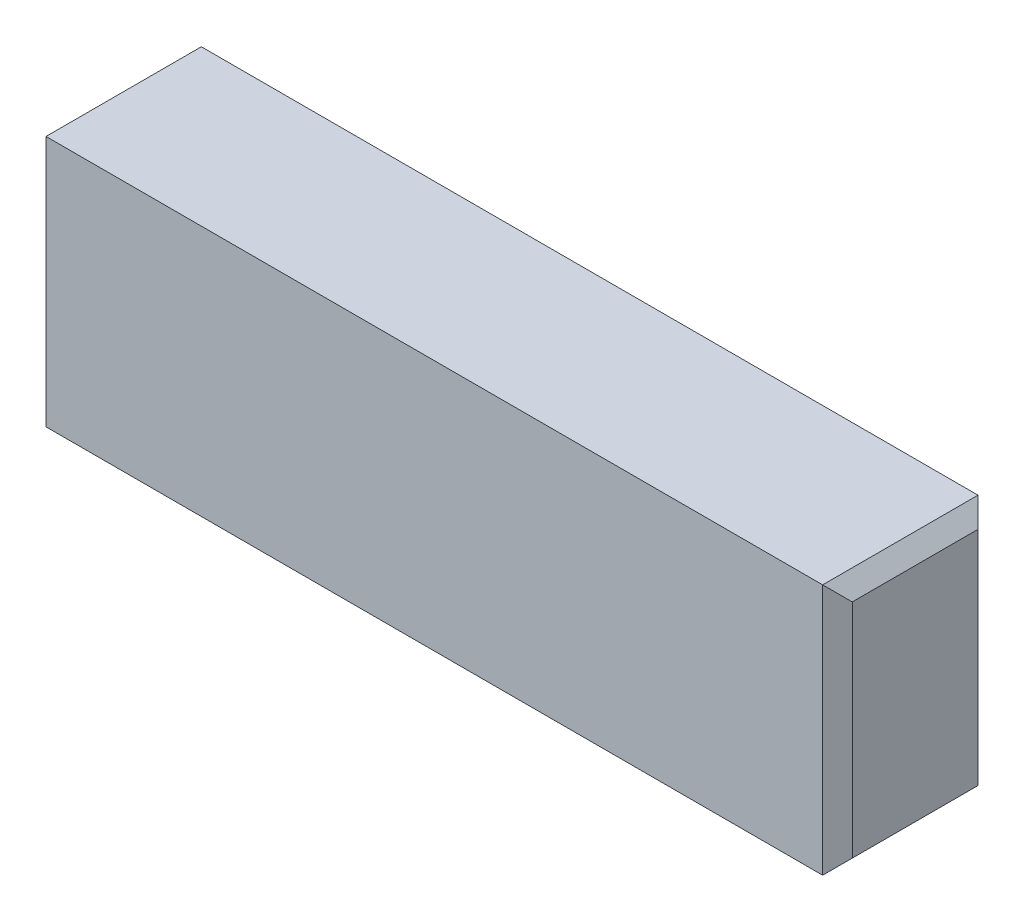
ISO-10303-21;
HEADER;
FILE_DESCRIPTION(('STEP AP214'),'2;1');
FILE_NAME('part.step','',(''),(''),'','','');
FILE_SCHEMA(('AUTOMOTIVE_DESIGN { 1 0 10303 214 1 1 1 1 }'));
ENDSEC;
DATA;
#1=APPLICATION_CONTEXT('core data for automotive mechanical design processes');
#2=APPLICATION_PROTOCOL_DEFINITION('international standard','automotive_design',2000,#1);
#3=PRODUCT_CONTEXT('',#1,'mechanical');
#4=PRODUCT('Part','Part','',(#3));
#5=PRODUCT_RELATED_PRODUCT_CATEGORY('part','',(#4));
#6=PRODUCT_DEFINITION_FORMATION('','',#4);
#7=PRODUCT_DEFINITION_CONTEXT('part definition',#1,'design');
#8=PRODUCT_DEFINITION('design','',#6,#7);
#9=PRODUCT_DEFINITION_SHAPE('','',#8);
#10=(LENGTH_UNIT() NAMED_UNIT(*) SI_UNIT(.MILLI.,.METRE.));
#11=(NAMED_UNIT(*) PLANE_ANGLE_UNIT() SI_UNIT($,.RADIAN.));
#12=(NAMED_UNIT(*) SI_UNIT($,.STERADIAN.) SOLID_ANGLE_UNIT());
#13=UNCERTAINTY_MEASURE_WITH_UNIT(LENGTH_MEASURE(1.E-05),#10,'distance_accuracy_value','');
#14=(GEOMETRIC_REPRESENTATION_CONTEXT(3) GLOBAL_UNCERTAINTY_ASSIGNED_CONTEXT((#13)) GLOBAL_UNIT_ASSIGNED_CONTEXT((#10,
#11,#12)) REPRESENTATION_CONTEXT('',''));
#15=CARTESIAN_POINT('',(0.,0.,0.));
#16=DIRECTION('',(0.,0.,1.));
#17=DIRECTION('',(1.,0.,0.));
#18=AXIS2_PLACEMENT_3D('',#15,#16,#17);
#19=CARTESIAN_POINT('',(54.5,17.,21.));
#20=DIRECTION('',(-1.,0.,0.));
#21=DIRECTION('',(0.,0.,1.));
#22=AXIS2_PLACEMENT_3D('',#19,#20,#21);
#23=PLANE('',#22);
#24=DIRECTION('',(0.,-1.,0.));
#25=VECTOR('',#24,1.);
#26=CARTESIAN_POINT('',(54.5,-17.,19.));
#27=LINE('',#26,#25);
#28=CARTESIAN_POINT('',(54.5,15.,19.));
#29=VERTEX_POINT('',#28);
#30=CARTESIAN_POINT('',(54.5,-15.,19.));
#31=VERTEX_POINT('',#30);
#32=EDGE_CURVE('E46',#29,#31,#27,.T.);
#33=ORIENTED_EDGE('',*,*,#32,.T.);
#34=DIRECTION('',(0.,0.,-1.));
#35=VECTOR('',#34,1.);
#36=CARTESIAN_POINT('',(54.5,-15.,21.));
#37=LINE('',#36,#35);
#38=CARTESIAN_POINT('',(54.5,-15.,2.));
#39=VERTEX_POINT('',#38);
#40=EDGE_CURVE('E11',#31,#39,#37,.T.);
#41=ORIENTED_EDGE('',*,*,#40,.T.);
#42=DIRECTION('',(0.,1.,0.));
#43=VECTOR('',#42,1.);
#44=CARTESIAN_POINT('',(54.5,17.,2.));
#45=LINE('',#44,#43);
#46=CARTESIAN_POINT('',(54.5,15.,2.));
#47=VERTEX_POINT('',#46);
#48=EDGE_CURVE('E148',#39,#47,#45,.T.);
#49=ORIENTED_EDGE('',*,*,#48,.T.);
#50=DIRECTION('',(0.,0.,1.));
#51=VECTOR('',#50,1.);
#52=CARTESIAN_POINT('',(54.5,15.,21.));
#53=LINE('',#52,#51);
#54=EDGE_CURVE('E57',#47,#29,#53,.T.);
#55=ORIENTED_EDGE('',*,*,#54,.T.);
#56=EDGE_LOOP('',(#33,#41,#49,#55));
#57=FACE_BOUND('',#56,.T.);
#58=ADVANCED_FACE('F36',(#57),#23,.F.);
#59=CARTESIAN_POINT('',(-54.5,17.,21.));
#60=DIRECTION('',(0.,-1.,0.));
#61=DIRECTION('',(0.,0.,-1.));
#62=AXIS2_PLACEMENT_3D('',#59,#60,#61);
#63=PLANE('',#62);
#64=DIRECTION('',(-1.,0.,0.));
#65=VECTOR('',#64,1.);
#66=CARTESIAN_POINT('',(-54.5,17.,0.));
#67=LINE('',#66,#65);
#68=CARTESIAN_POINT('',(52.5,17.,0.));
#69=VERTEX_POINT('',#68);
#70=CARTESIAN_POINT('',(-52.5,17.,0.));
#71=VERTEX_POINT('',#70);
#72=EDGE_CURVE('E157',#69,#71,#67,.T.);
#73=ORIENTED_EDGE('',*,*,#72,.T.);
#74=DIRECTION('',(0.,0.,1.));
#75=VECTOR('',#74,1.);
#76=CARTESIAN_POINT('',(-52.5,17.,21.));
#77=LINE('',#76,#75);
#78=CARTESIAN_POINT('',(-52.5,17.,21.));
#79=VERTEX_POINT('',#78);
#80=EDGE_CURVE('E109',#71,#79,#77,.T.);
#81=ORIENTED_EDGE('',*,*,#80,.T.);
#82=DIRECTION('',(-1.,0.,0.));
#83=VECTOR('',#82,1.);
#84=CARTESIAN_POINT('',(-54.5,17.,21.));
#85=LINE('',#84,#83);
#86=CARTESIAN_POINT('',(52.5,17.,21.));
#87=VERTEX_POINT('',#86);
#88=EDGE_CURVE('E179',#87,#79,#85,.T.);
#89=ORIENTED_EDGE('',*,*,#88,.F.);
#90=DIRECTION('',(0.,0.,-1.));
#91=VECTOR('',#90,1.);
#92=CARTESIAN_POINT('',(52.5,17.,21.));
#93=LINE('',#92,#91);
#94=EDGE_CURVE('E128',#87,#69,#93,.T.);
#95=ORIENTED_EDGE('',*,*,#94,.T.);
#96=EDGE_LOOP('',(#73,#81,#89,#95));
#97=FACE_BOUND('',#96,.T.);
#98=ADVANCED_FACE('F177',(#97),#63,.F.);
#99=CARTESIAN_POINT('',(-54.5,17.,21.));
#100=DIRECTION('',(1.,0.,0.));
#101=DIRECTION('',(0.,0.,-1.));
#102=AXIS2_PLACEMENT_3D('',#99,#100,#101);
#103=PLANE('',#102);
#104=DIRECTION('',(0.,1.,0.));
#105=VECTOR('',#104,1.);
#106=CARTESIAN_POINT('',(-54.5,17.,19.));
#107=LINE('',#106,#105);
#108=CARTESIAN_POINT('',(-54.5,-15.,19.));
#109=VERTEX_POINT('',#108);
#110=CARTESIAN_POINT('',(-54.5,15.,19.));
#111=VERTEX_POINT('',#110);
#112=EDGE_CURVE('E126',#109,#111,#107,.T.);
#113=ORIENTED_EDGE('',*,*,#112,.T.);
#114=DIRECTION('',(0.,0.,-1.));
#115=VECTOR('',#114,1.);
#116=CARTESIAN_POINT('',(-54.5,15.,21.));
#117=LINE('',#116,#115);
#118=CARTESIAN_POINT('',(-54.5,15.,2.));
#119=VERTEX_POINT('',#118);
#120=EDGE_CURVE('E107',#111,#119,#117,.T.);
#121=ORIENTED_EDGE('',*,*,#120,.T.);
#122=DIRECTION('',(0.,-1.,0.));
#123=VECTOR('',#122,1.);
#124=CARTESIAN_POINT('',(-54.5,17.,2.));
#125=LINE('',#124,#123);
#126=CARTESIAN_POINT('',(-54.5,-15.,2.));
#127=VERTEX_POINT('',#126);
#128=EDGE_CURVE('E115',#119,#127,#125,.T.);
#129=ORIENTED_EDGE('',*,*,#128,.T.);
#130=DIRECTION('',(0.,0.,1.));
#131=VECTOR('',#130,1.);
#132=CARTESIAN_POINT('',(-54.5,-15.,21.));
#133=LINE('',#132,#131);
#134=EDGE_CURVE('E121',#127,#109,#133,.T.);
#135=ORIENTED_EDGE('',*,*,#134,.T.);
#136=EDGE_LOOP('',(#113,#121,#129,#135));
#137=FACE_BOUND('',#136,.T.);
#138=ADVANCED_FACE('F124',(#137),#103,.F.);
#139=CARTESIAN_POINT('',(-54.5,-17.,21.));
#140=DIRECTION('',(0.,1.,0.));
#141=DIRECTION('',(0.,0.,1.));
#142=AXIS2_PLACEMENT_3D('',#139,#140,#141);
#143=PLANE('',#142);
#144=DIRECTION('',(1.,0.,0.));
#145=VECTOR('',#144,1.);
#146=CARTESIAN_POINT('',(-54.5,-17.,21.));
#147=LINE('',#146,#145);
#148=CARTESIAN_POINT('',(-52.5,-17.,21.));
#149=VERTEX_POINT('',#148);
#150=CARTESIAN_POINT('',(52.5,-17.,21.));
#151=VERTEX_POINT('',#150);
#152=EDGE_CURVE('E122',#149,#151,#147,.T.);
#153=ORIENTED_EDGE('',*,*,#152,.F.);
#154=DIRECTION('',(0.,0.,-1.));
#155=VECTOR('',#154,1.);
#156=CARTESIAN_POINT('',(-52.5,-17.,21.));
#157=LINE('',#156,#155);
#158=CARTESIAN_POINT('',(-52.5,-17.,0.));
#159=VERTEX_POINT('',#158);
#160=EDGE_CURVE('E142',#149,#159,#157,.T.);
#161=ORIENTED_EDGE('',*,*,#160,.T.);
#162=DIRECTION('',(1.,0.,0.));
#163=VECTOR('',#162,1.);
#164=CARTESIAN_POINT('',(-54.5,-17.,0.));
#165=LINE('',#164,#163);
#166=CARTESIAN_POINT('',(52.5,-17.,0.));
#167=VERTEX_POINT('',#166);
#168=EDGE_CURVE('E184',#159,#167,#165,.T.);
#169=ORIENTED_EDGE('',*,*,#168,.T.);
#170=DIRECTION('',(0.,0.,1.));
#171=VECTOR('',#170,1.);
#172=CARTESIAN_POINT('',(52.5,-17.,21.));
#173=LINE('',#172,#171);
#174=EDGE_CURVE('E139',#167,#151,#173,.T.);
#175=ORIENTED_EDGE('',*,*,#174,.T.);
#176=EDGE_LOOP('',(#153,#161,#169,#175));
#177=FACE_BOUND('',#176,.T.);
#178=ADVANCED_FACE('F201',(#177),#143,.F.);
#179=CARTESIAN_POINT('',(0.,0.,21.));
#180=DIRECTION('',(0.,0.,1.));
#181=DIRECTION('',(1.,0.,0.));
#182=AXIS2_PLACEMENT_3D('',#179,#180,#181);
#183=PLANE('',#182);
#184=ORIENTED_EDGE('',*,*,#88,.T.);
#185=DIRECTION('',(0.,-1.,0.));
#186=VECTOR('',#185,1.);
#187=CARTESIAN_POINT('',(-52.5,-17.,21.));
#188=LINE('',#187,#186);
#189=EDGE_CURVE('E137',#79,#149,#188,.T.);
#190=ORIENTED_EDGE('',*,*,#189,.T.);
#191=ORIENTED_EDGE('',*,*,#152,.T.);
#192=DIRECTION('',(0.,1.,0.));
#193=VECTOR('',#192,1.);
#194=CARTESIAN_POINT('',(52.5,17.,21.));
#195=LINE('',#194,#193);
#196=EDGE_CURVE('E135',#151,#87,#195,.T.);
#197=ORIENTED_EDGE('',*,*,#196,.T.);
#198=EDGE_LOOP('',(#184,#190,#191,#197));
#199=FACE_BOUND('',#198,.T.);
#200=ADVANCED_FACE('F199',(#199),#183,.T.);
#201=CARTESIAN_POINT('',(0.,0.,0.));
#202=DIRECTION('',(0.,0.,1.));
#203=DIRECTION('',(1.,0.,0.));
#204=AXIS2_PLACEMENT_3D('',#201,#202,#203);
#205=PLANE('',#204);
#206=ORIENTED_EDGE('',*,*,#168,.F.);
#207=DIRECTION('',(0.,1.,0.));
#208=VECTOR('',#207,1.);
#209=CARTESIAN_POINT('',(-52.5,0.,0.));
#210=LINE('',#209,#208);
#211=EDGE_CURVE('E146',#159,#71,#210,.T.);
#212=ORIENTED_EDGE('',*,*,#211,.T.);
#213=ORIENTED_EDGE('',*,*,#72,.F.);
#214=DIRECTION('',(0.,-1.,0.));
#215=VECTOR('',#214,1.);
#216=CARTESIAN_POINT('',(52.5,0.,0.));
#217=LINE('',#216,#215);
#218=EDGE_CURVE('E144',#69,#167,#217,.T.);
#219=ORIENTED_EDGE('',*,*,#218,.T.);
#220=EDGE_LOOP('',(#206,#212,#213,#219));
#221=FACE_BOUND('',#220,.T.);
#222=ADVANCED_FACE('F182',(#221),#205,.F.);
#223=CARTESIAN_POINT('',(-52.5,-17.,21.));
#224=DIRECTION('',(0.707106781186546,0.707106781186549,0.));
#225=DIRECTION('',(0.,0.,-1.));
#226=AXIS2_PLACEMENT_3D('',#223,#224,#225);
#227=PLANE('',#226);
#228=DIRECTION('',(-0.577350269189628,0.577350269189626,0.577350269189624));
#229=VECTOR('',#228,1.);
#230=CARTESIAN_POINT('',(-65.1666666666667,-4.33333333333333,12.6666666666666));
#231=LINE('',#230,#229);
#232=EDGE_CURVE('E118',#159,#127,#231,.T.);
#233=ORIENTED_EDGE('',*,*,#232,.F.);
#234=ORIENTED_EDGE('',*,*,#160,.F.);
#235=DIRECTION('',(0.577350269189628,-0.577350269189626,0.577350269189624));
#236=VECTOR('',#235,1.);
#237=CARTESIAN_POINT('',(-52.5,-17.,21.));
#238=LINE('',#237,#236);
#239=EDGE_CURVE('E154',#109,#149,#238,.T.);
#240=ORIENTED_EDGE('',*,*,#239,.F.);
#241=ORIENTED_EDGE('',*,*,#134,.F.);
#242=EDGE_LOOP('',(#233,#234,#240,#241));
#243=FACE_BOUND('',#242,.T.);
#244=ADVANCED_FACE('F192',(#243),#227,.F.);
#245=CARTESIAN_POINT('',(-52.5,0.,21.));
#246=DIRECTION('',(-0.707106781186545,0.,0.70710678118655));
#247=DIRECTION('',(0.,1.,0.));
#248=AXIS2_PLACEMENT_3D('',#245,#246,#247);
#249=PLANE('',#248);
#250=ORIENTED_EDGE('',*,*,#239,.T.);
#251=ORIENTED_EDGE('',*,*,#189,.F.);
#252=DIRECTION('',(0.577350269189628,0.577350269189624,0.577350269189624));
#253=VECTOR('',#252,1.);
#254=CARTESIAN_POINT('',(-58.1666666666667,11.3333333333334,15.3333333333334));
#255=LINE('',#254,#253);
#256=EDGE_CURVE('E112',#111,#79,#255,.T.);
#257=ORIENTED_EDGE('',*,*,#256,.F.);
#258=ORIENTED_EDGE('',*,*,#112,.F.);
#259=EDGE_LOOP('',(#250,#251,#257,#258));
#260=FACE_BOUND('',#259,.T.);
#261=ADVANCED_FACE('F195',(#260),#249,.T.);
#262=CARTESIAN_POINT('',(-54.5,17.,2.));
#263=DIRECTION('',(0.707106781186545,0.,0.70710678118655));
#264=DIRECTION('',(0.,-1.,0.));
#265=AXIS2_PLACEMENT_3D('',#262,#263,#264);
#266=PLANE('',#265);
#267=ORIENTED_EDGE('',*,*,#232,.T.);
#268=ORIENTED_EDGE('',*,*,#128,.F.);
#269=DIRECTION('',(0.577350269189628,0.577350269189624,-0.577350269189624));
#270=VECTOR('',#269,1.);
#271=CARTESIAN_POINT('',(-53.8333333333333,15.6666666666667,1.33333333333334));
#272=LINE('',#271,#270);
#273=EDGE_CURVE('E103',#71,#119,#272,.F.);
#274=ORIENTED_EDGE('',*,*,#273,.F.);
#275=ORIENTED_EDGE('',*,*,#211,.F.);
#276=EDGE_LOOP('',(#267,#268,#274,#275));
#277=FACE_BOUND('',#276,.T.);
#278=ADVANCED_FACE('F116',(#277),#266,.F.);
#279=CARTESIAN_POINT('',(-54.5,15.,21.));
#280=DIRECTION('',(0.707106781186545,-0.70710678118655,0.));
#281=DIRECTION('',(0.,0.,-1.));
#282=AXIS2_PLACEMENT_3D('',#279,#280,#281);
#283=PLANE('',#282);
#284=ORIENTED_EDGE('',*,*,#256,.T.);
#285=ORIENTED_EDGE('',*,*,#80,.F.);
#286=ORIENTED_EDGE('',*,*,#273,.T.);
#287=ORIENTED_EDGE('',*,*,#120,.F.);
#288=EDGE_LOOP('',(#284,#285,#286,#287));
#289=FACE_BOUND('',#288,.T.);
#290=ADVANCED_FACE('F105',(#289),#283,.F.);
#291=CARTESIAN_POINT('',(52.5,17.,21.));
#292=DIRECTION('',(-0.707106781186545,-0.70710678118655,0.));
#293=DIRECTION('',(0.,0.,-1.));
#294=AXIS2_PLACEMENT_3D('',#291,#292,#293);
#295=PLANE('',#294);
#296=DIRECTION('',(0.577350269189628,-0.577350269189624,0.577350269189624));
#297=VECTOR('',#296,1.);
#298=CARTESIAN_POINT('',(53.8333333333333,15.6666666666667,1.33333333333334));
#299=LINE('',#298,#297);
#300=EDGE_CURVE('E161',#69,#47,#299,.T.);
#301=ORIENTED_EDGE('',*,*,#300,.F.);
#302=ORIENTED_EDGE('',*,*,#94,.F.);
#303=DIRECTION('',(-0.577350269189628,0.577350269189624,0.577350269189624));
#304=VECTOR('',#303,1.);
#305=CARTESIAN_POINT('',(52.5,17.,21.));
#306=LINE('',#305,#304);
#307=EDGE_CURVE('E41',#29,#87,#306,.T.);
#308=ORIENTED_EDGE('',*,*,#307,.F.);
#309=ORIENTED_EDGE('',*,*,#54,.F.);
#310=EDGE_LOOP('',(#301,#302,#308,#309));
#311=FACE_BOUND('',#310,.T.);
#312=ADVANCED_FACE('F39',(#311),#295,.F.);
#313=CARTESIAN_POINT('',(52.5,0.,21.));
#314=DIRECTION('',(0.707106781186545,0.,0.70710678118655));
#315=DIRECTION('',(0.,-1.,0.));
#316=AXIS2_PLACEMENT_3D('',#313,#314,#315);
#317=PLANE('',#316);
#318=ORIENTED_EDGE('',*,*,#307,.T.);
#319=ORIENTED_EDGE('',*,*,#196,.F.);
#320=DIRECTION('',(-0.577350269189628,-0.577350269189626,0.577350269189624));
#321=VECTOR('',#320,1.);
#322=CARTESIAN_POINT('',(58.1666666666667,-11.3333333333333,15.3333333333334));
#323=LINE('',#322,#321);
#324=EDGE_CURVE('E160',#31,#151,#323,.T.);
#325=ORIENTED_EDGE('',*,*,#324,.F.);
#326=ORIENTED_EDGE('',*,*,#32,.F.);
#327=EDGE_LOOP('',(#318,#319,#325,#326));
#328=FACE_BOUND('',#327,.T.);
#329=ADVANCED_FACE('F170',(#328),#317,.T.);
#330=CARTESIAN_POINT('',(54.5,17.,2.));
#331=DIRECTION('',(-0.707106781186545,0.,0.70710678118655));
#332=DIRECTION('',(0.,1.,0.));
#333=AXIS2_PLACEMENT_3D('',#330,#331,#332);
#334=PLANE('',#333);
#335=ORIENTED_EDGE('',*,*,#300,.T.);
#336=ORIENTED_EDGE('',*,*,#48,.F.);
#337=DIRECTION('',(-0.577350269189628,-0.577350269189626,-0.577350269189624));
#338=VECTOR('',#337,1.);
#339=CARTESIAN_POINT('',(65.1666666666667,-4.33333333333333,12.6666666666666));
#340=LINE('',#339,#338);
#341=EDGE_CURVE('E158',#167,#39,#340,.F.);
#342=ORIENTED_EDGE('',*,*,#341,.F.);
#343=ORIENTED_EDGE('',*,*,#218,.F.);
#344=EDGE_LOOP('',(#335,#336,#342,#343));
#345=FACE_BOUND('',#344,.T.);
#346=ADVANCED_FACE('F207',(#345),#334,.F.);
#347=CARTESIAN_POINT('',(54.5,-15.,21.));
#348=DIRECTION('',(-0.707106781186546,0.707106781186549,0.));
#349=DIRECTION('',(0.,0.,-1.));
#350=AXIS2_PLACEMENT_3D('',#347,#348,#349);
#351=PLANE('',#350);
#352=ORIENTED_EDGE('',*,*,#324,.T.);
#353=ORIENTED_EDGE('',*,*,#174,.F.);
#354=ORIENTED_EDGE('',*,*,#341,.T.);
#355=ORIENTED_EDGE('',*,*,#40,.F.);
#356=EDGE_LOOP('',(#352,#353,#354,#355));
#357=FACE_BOUND('',#356,.T.);
#358=ADVANCED_FACE('F205',(#357),#351,.F.);
#359=CLOSED_SHELL('',(#58,#98,#138,#178,#200,#222,#244,#261,#278,#290,#312,#329,#346,#358));
#360=MANIFOLD_SOLID_BREP('B2',#359);
#361=ADVANCED_BREP_SHAPE_REPRESENTATION('',(#18,#360),#14);
#362=SHAPE_DEFINITION_REPRESENTATION(#9,#361);
ENDSEC;
END-ISO-10303-21;
